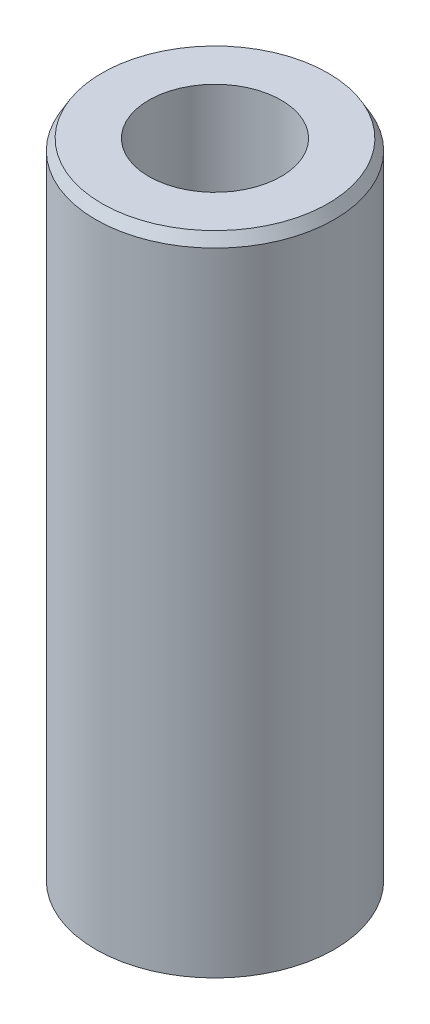
ISO-10303-21;
HEADER;
FILE_DESCRIPTION(('STEP AP214'),'2;1');
FILE_NAME('part.step','',(''),(''),'','','');
FILE_SCHEMA(('AUTOMOTIVE_DESIGN { 1 0 10303 214 1 1 1 1 }'));
ENDSEC;
DATA;
#1=APPLICATION_CONTEXT('core data for automotive mechanical design processes');
#2=APPLICATION_PROTOCOL_DEFINITION('international standard','automotive_design',2000,#1);
#3=PRODUCT_CONTEXT('',#1,'mechanical');
#4=PRODUCT('Part','Part','',(#3));
#5=PRODUCT_RELATED_PRODUCT_CATEGORY('part','',(#4));
#6=PRODUCT_DEFINITION_FORMATION('','',#4);
#7=PRODUCT_DEFINITION_CONTEXT('part definition',#1,'design');
#8=PRODUCT_DEFINITION('design','',#6,#7);
#9=PRODUCT_DEFINITION_SHAPE('','',#8);
#10=(LENGTH_UNIT() NAMED_UNIT(*) SI_UNIT(.MILLI.,.METRE.));
#11=(NAMED_UNIT(*) PLANE_ANGLE_UNIT() SI_UNIT($,.RADIAN.));
#12=(NAMED_UNIT(*) SI_UNIT($,.STERADIAN.) SOLID_ANGLE_UNIT());
#13=UNCERTAINTY_MEASURE_WITH_UNIT(LENGTH_MEASURE(1.E-05),#10,'distance_accuracy_value','');
#14=(GEOMETRIC_REPRESENTATION_CONTEXT(3) GLOBAL_UNCERTAINTY_ASSIGNED_CONTEXT((#13)) GLOBAL_UNIT_ASSIGNED_CONTEXT((#10,
#11,#12)) REPRESENTATION_CONTEXT('',''));
#15=CARTESIAN_POINT('',(0.,0.,0.));
#16=DIRECTION('',(0.,0.,1.));
#17=DIRECTION('',(1.,0.,0.));
#18=AXIS2_PLACEMENT_3D('',#15,#16,#17);
#19=CARTESIAN_POINT('',(0.,149.621601819265,0.));
#20=DIRECTION('',(0.,-1.,0.));
#21=DIRECTION('',(0.,0.,-1.));
#22=AXIS2_PLACEMENT_3D('',#19,#20,#21);
#23=CYLINDRICAL_SURFACE('',#22,27.5);
#24=CARTESIAN_POINT('',(0.,147.140797151408,0.));
#25=DIRECTION('',(0.,1.,0.));
#26=DIRECTION('',(0.,0.,1.));
#27=AXIS2_PLACEMENT_3D('',#24,#25,#26);
#28=CIRCLE('',#27,27.5);
#29=CARTESIAN_POINT('',(0.,147.140797151408,-27.5));
#30=VERTEX_POINT('',#29);
#31=EDGE_CURVE('E50',#30,#30,#28,.F.);
#32=ORIENTED_EDGE('',*,*,#31,.T.);
#33=EDGE_LOOP('',(#32));
#34=FACE_BOUND('',#33,.T.);
#35=CARTESIAN_POINT('',(0.,1.43229324279417,0.));
#36=DIRECTION('',(0.,1.,0.));
#37=DIRECTION('',(0.,0.,1.));
#38=AXIS2_PLACEMENT_3D('',#35,#36,#37);
#39=CIRCLE('',#38,27.5);
#40=CARTESIAN_POINT('',(0.,1.43229324279417,27.5));
#41=VERTEX_POINT('',#40);
#42=EDGE_CURVE('E51',#41,#41,#39,.T.);
#43=ORIENTED_EDGE('',*,*,#42,.T.);
#44=EDGE_LOOP('',(#43));
#45=FACE_BOUND('',#44,.T.);
#46=ADVANCED_FACE('F39',(#34,#45),#23,.T.);
#47=CARTESIAN_POINT('',(0.,149.621601819265,0.));
#48=DIRECTION('',(0.,1.,0.));
#49=DIRECTION('',(0.,0.,1.));
#50=AXIS2_PLACEMENT_3D('',#47,#48,#49);
#51=PLANE('',#50);
#52=CARTESIAN_POINT('',(0.,149.621601819265,0.));
#53=DIRECTION('',(0.,1.,0.));
#54=DIRECTION('',(0.,0.,1.));
#55=AXIS2_PLACEMENT_3D('',#52,#53,#54);
#56=CIRCLE('',#55,26.0677067572058);
#57=CARTESIAN_POINT('',(0.,149.621601819265,-26.0677067572058));
#58=VERTEX_POINT('',#57);
#59=EDGE_CURVE('E54',#58,#58,#56,.T.);
#60=ORIENTED_EDGE('',*,*,#59,.T.);
#61=EDGE_LOOP('',(#60));
#62=FACE_BOUND('',#61,.T.);
#63=CARTESIAN_POINT('',(0.,149.621601819265,0.));
#64=DIRECTION('',(0.,1.,0.));
#65=DIRECTION('',(0.,0.,1.));
#66=AXIS2_PLACEMENT_3D('',#63,#64,#65);
#67=CIRCLE('',#66,15.2597651776269);
#68=CARTESIAN_POINT('',(0.,149.621601819265,15.2597651776269));
#69=VERTEX_POINT('',#68);
#70=EDGE_CURVE('E58',#69,#69,#67,.T.);
#71=ORIENTED_EDGE('',*,*,#70,.F.);
#72=EDGE_LOOP('',(#71));
#73=FACE_BOUND('',#72,.T.);
#74=ADVANCED_FACE('F69',(#62,#73),#51,.T.);
#75=CARTESIAN_POINT('',(0.,0.,0.));
#76=DIRECTION('',(0.,1.,0.));
#77=DIRECTION('',(0.,0.,1.));
#78=AXIS2_PLACEMENT_3D('',#75,#76,#77);
#79=PLANE('',#78);
#80=CARTESIAN_POINT('',(0.,0.,0.));
#81=DIRECTION('',(0.,1.,0.));
#82=DIRECTION('',(0.,0.,1.));
#83=AXIS2_PLACEMENT_3D('',#80,#81,#82);
#84=CIRCLE('',#83,25.0191953321429);
#85=CARTESIAN_POINT('',(0.,0.,25.0191953321429));
#86=VERTEX_POINT('',#85);
#87=EDGE_CURVE('E10',#86,#86,#84,.F.);
#88=ORIENTED_EDGE('',*,*,#87,.T.);
#89=EDGE_LOOP('',(#88));
#90=FACE_BOUND('',#89,.T.);
#91=CARTESIAN_POINT('',(0.,0.,0.));
#92=DIRECTION('',(0.,1.,0.));
#93=DIRECTION('',(0.,0.,1.));
#94=AXIS2_PLACEMENT_3D('',#91,#92,#93);
#95=CIRCLE('',#94,15.2597651776269);
#96=CARTESIAN_POINT('',(0.,0.,15.2597651776269));
#97=VERTEX_POINT('',#96);
#98=EDGE_CURVE('E63',#97,#97,#95,.T.);
#99=ORIENTED_EDGE('',*,*,#98,.T.);
#100=EDGE_LOOP('',(#99));
#101=FACE_BOUND('',#100,.T.);
#102=ADVANCED_FACE('F75',(#90,#101),#79,.F.);
#103=CARTESIAN_POINT('',(0.,149.621601819265,0.));
#104=DIRECTION('',(0.,-1.,0.));
#105=DIRECTION('',(0.,0.,-1.));
#106=AXIS2_PLACEMENT_3D('',#103,#104,#105);
#107=CYLINDRICAL_SURFACE('',#106,15.2597651776269);
#108=ORIENTED_EDGE('',*,*,#70,.T.);
#109=EDGE_LOOP('',(#108));
#110=FACE_BOUND('',#109,.T.);
#111=ORIENTED_EDGE('',*,*,#98,.F.);
#112=EDGE_LOOP('',(#111));
#113=FACE_BOUND('',#112,.T.);
#114=ADVANCED_FACE('F70',(#110,#113),#107,.F.);
#115=CARTESIAN_POINT('',(0.,149.621601819265,0.));
#116=DIRECTION('',(0.,-1.,0.));
#117=DIRECTION('',(0.,0.,-1.));
#118=AXIS2_PLACEMENT_3D('',#115,#116,#117);
#119=CONICAL_SURFACE('',#118,26.0677067572058,0.523598775598292);
#120=CARTESIAN_POINT('',(0.,147.140797151408,-27.5));
#121=CARTESIAN_POINT('',(0.,147.166638866698,-27.4850802787209));
#122=CARTESIAN_POINT('',(0.,147.192480581988,-27.4701605574418));
#123=CARTESIAN_POINT('',(0.,147.244164012569,-27.4403211148836));
#124=CARTESIAN_POINT('',(0.,147.270005727859,-27.4254013936045));
#125=CARTESIAN_POINT('',(0.,147.321689158439,-27.3955619510463));
#126=CARTESIAN_POINT('',(0.,147.347530873729,-27.3806422297672));
#127=CARTESIAN_POINT('',(0.,147.39921430431,-27.3508027872089));
#128=CARTESIAN_POINT('',(0.,147.4250560196,-27.3358830659298));
#129=CARTESIAN_POINT('',(0.,147.47673945018,-27.3060436233716));
#130=CARTESIAN_POINT('',(0.,147.50258116547,-27.2911239020925));
#131=CARTESIAN_POINT('',(0.,147.554264596051,-27.2612844595343));
#132=CARTESIAN_POINT('',(0.,147.580106311341,-27.2463647382552));
#133=CARTESIAN_POINT('',(0.,147.631789741921,-27.216525295697));
#134=CARTESIAN_POINT('',(0.,147.657631457211,-27.2016055744179));
#135=CARTESIAN_POINT('',(0.,147.709314887792,-27.1717661318597));
#136=CARTESIAN_POINT('',(0.,147.735156603082,-27.1568464105806));
#137=CARTESIAN_POINT('',(0.,147.786840033662,-27.1270069680224));
#138=CARTESIAN_POINT('',(0.,147.812681748953,-27.1120872467432));
#139=CARTESIAN_POINT('',(0.,147.864365179533,-27.082247804185));
#140=CARTESIAN_POINT('',(0.,147.890206894823,-27.0673280829059));
#141=CARTESIAN_POINT('',(0.,147.941890325403,-27.0374886403477));
#142=CARTESIAN_POINT('',(0.,147.967732040694,-27.0225689190686));
#143=CARTESIAN_POINT('',(0.,148.019415471274,-26.9927294765104));
#144=CARTESIAN_POINT('',(0.,148.045257186564,-26.9778097552313));
#145=CARTESIAN_POINT('',(0.,148.096940617145,-26.9479703126731));
#146=CARTESIAN_POINT('',(0.,148.122782332435,-26.933050591394));
#147=CARTESIAN_POINT('',(0.,148.174465763015,-26.9032111488358));
#148=CARTESIAN_POINT('',(0.,148.200307478305,-26.8882914275566));
#149=CARTESIAN_POINT('',(0.,148.251990908886,-26.8584519849984));
#150=CARTESIAN_POINT('',(0.,148.277832624176,-26.8435322637193));
#151=CARTESIAN_POINT('',(0.,148.329516054756,-26.8136928211611));
#152=CARTESIAN_POINT('',(0.,148.355357770046,-26.798773099882));
#153=CARTESIAN_POINT('',(0.,148.407041200627,-26.7689336573238));
#154=CARTESIAN_POINT('',(0.,148.432882915917,-26.7540139360447));
#155=CARTESIAN_POINT('',(0.,148.484566346497,-26.7241744934865));
#156=CARTESIAN_POINT('',(0.,148.510408061787,-26.7092547722074));
#157=CARTESIAN_POINT('',(0.,148.562091492368,-26.6794153296492));
#158=CARTESIAN_POINT('',(0.,148.587933207658,-26.66449560837));
#159=CARTESIAN_POINT('',(0.,148.639616638238,-26.6346561658118));
#160=CARTESIAN_POINT('',(0.,148.665458353528,-26.6197364445327));
#161=CARTESIAN_POINT('',(0.,148.717141784109,-26.5898970019745));
#162=CARTESIAN_POINT('',(0.,148.742983499399,-26.5749772806954));
#163=CARTESIAN_POINT('',(0.,148.794666929979,-26.5451378381372));
#164=CARTESIAN_POINT('',(0.,148.82050864527,-26.5302181168581));
#165=CARTESIAN_POINT('',(0.,148.87219207585,-26.5003786742999));
#166=CARTESIAN_POINT('',(0.,148.89803379114,-26.4854589530208));
#167=CARTESIAN_POINT('',(0.,148.94971722172,-26.4556195104626));
#168=CARTESIAN_POINT('',(0.,148.975558937011,-26.4406997891835));
#169=CARTESIAN_POINT('',(0.,149.027242367591,-26.4108603466252));
#170=CARTESIAN_POINT('',(0.,149.053084082881,-26.3959406253461));
#171=CARTESIAN_POINT('',(0.,149.104767513461,-26.3661011827879));
#172=CARTESIAN_POINT('',(0.,149.130609228752,-26.3511814615088));
#173=CARTESIAN_POINT('',(0.,149.182292659332,-26.3213420189506));
#174=CARTESIAN_POINT('',(0.,149.208134374622,-26.3064222976715));
#175=CARTESIAN_POINT('',(0.,149.259817805203,-26.2765828551133));
#176=CARTESIAN_POINT('',(0.,149.285659520493,-26.2616631338342));
#177=CARTESIAN_POINT('',(0.,149.337342951073,-26.231823691276));
#178=CARTESIAN_POINT('',(0.,149.363184666363,-26.2169039699968));
#179=CARTESIAN_POINT('',(0.,149.414868096944,-26.1870645274386));
#180=CARTESIAN_POINT('',(0.,149.440709812234,-26.1721448061595));
#181=CARTESIAN_POINT('',(0.,149.492393242814,-26.1423053636013));
#182=CARTESIAN_POINT('',(0.,149.518234958104,-26.1273856423222));
#183=CARTESIAN_POINT('',(0.,149.569918388685,-26.097546199764));
#184=CARTESIAN_POINT('',(0.,149.595760103975,-26.0826264784849));
#185=CARTESIAN_POINT('',(0.,149.621601819265,-26.0677067572058));
#186=B_SPLINE_CURVE_WITH_KNOTS('',3,(#120,#121,#122,#123,#124,#125,#126,#127,#128,#129,#130,
#131,#132,#133,#134,#135,#136,#137,#138,#139,#140,#141,#142,#143,#144,#145,#146,#147,#148,#149,
#150,#151,#152,#153,#154,#155,#156,#157,#158,#159,#160,#161,#162,#163,#164,#165,#166,#167,#168,
#169,#170,#171,#172,#173,#174,#175,#176,#177,#178,#179,#180,#181,#182,#183,#184,#185),
.UNSPECIFIED.,.F.,.F.,(4,2,2,2,2,2,2,2,2,2,2,2,2,2,2,2,2,2,2,2,2,2,2,2,2,2,2,2,2,2,2,2,4),(0.,
0.0895183276746583,0.179036655349294,0.26855498302393,0.358073310698564,0.4475916383732,
0.53710996604786,0.626628293722495,0.716146621397131,0.805664949071766,0.895183276746401,
0.984701604421061,1.0742199320957,1.16373825977033,1.25325658744497,1.3427749151196,
1.43229324279424,1.5218115704689,1.61132989814353,1.70084822581817,1.7903665534928,
1.87988488116744,1.9694032088421,2.05892153651673,2.14843986419137,2.237958191866,
2.32747651954064,2.4169948472153,2.50651317488993,2.59603150256457,2.68554983023921,
2.77506815791384,2.8645864855885),.UNSPECIFIED.);
#187=EDGE_CURVE('BSEAM81',#30,#58,#186,.T.);
#188=ORIENTED_EDGE('',*,*,#31,.F.);
#189=ORIENTED_EDGE('',*,*,#59,.F.);
#190=ORIENTED_EDGE('',*,*,#187,.T.);
#191=ORIENTED_EDGE('',*,*,#187,.F.);
#192=EDGE_LOOP('',(#188,#190,#189,#191));
#193=FACE_BOUND('',#192,.T.);
#194=ADVANCED_FACE('F81',(#193),#119,.T.);
#195=CARTESIAN_POINT('',(0.,1.43229324279417,0.));
#196=DIRECTION('',(0.,1.,0.));
#197=DIRECTION('',(0.,0.,1.));
#198=AXIS2_PLACEMENT_3D('',#195,#196,#197);
#199=CONICAL_SURFACE('',#198,27.5,1.04719755119661);
#200=ORIENTED_EDGE('',*,*,#87,.F.);
#201=EDGE_LOOP('',(#200));
#202=FACE_BOUND('',#201,.T.);
#203=ORIENTED_EDGE('',*,*,#42,.F.);
#204=EDGE_LOOP('',(#203));
#205=FACE_BOUND('',#204,.T.);
#206=ADVANCED_FACE('F45',(#202,#205),#199,.T.);
#207=CLOSED_SHELL('',(#46,#74,#102,#114,#194,#206));
#208=MANIFOLD_SOLID_BREP('B2',#207);
#209=ADVANCED_BREP_SHAPE_REPRESENTATION('',(#18,#208),#14);
#210=SHAPE_DEFINITION_REPRESENTATION(#9,#209);
ENDSEC;
END-ISO-10303-21;
